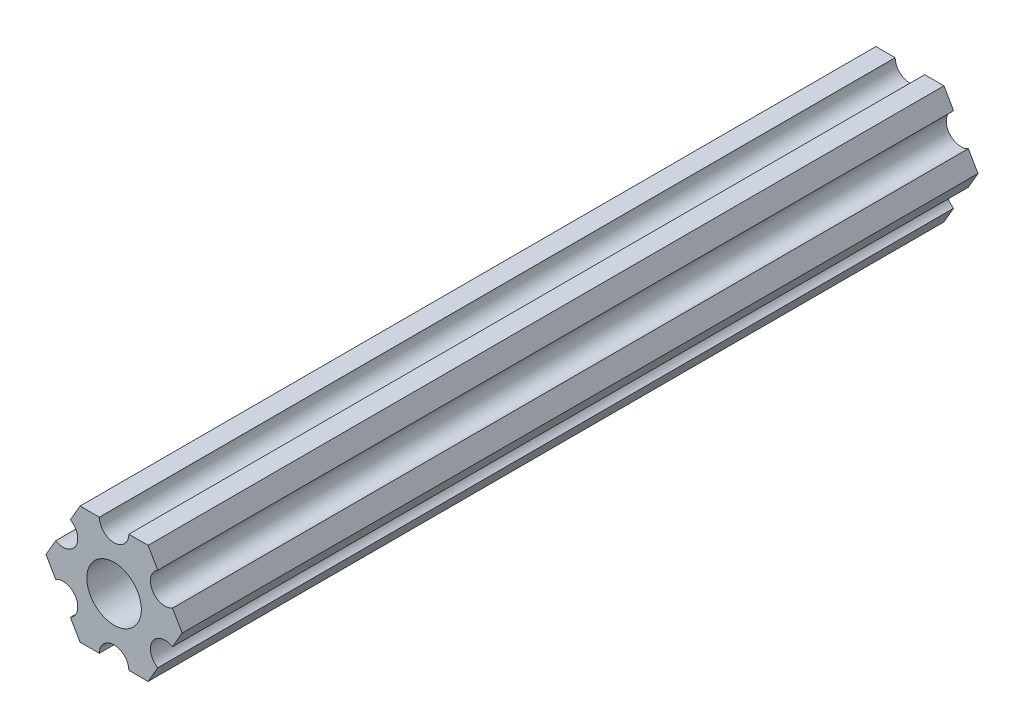
ISO-10303-21;
HEADER;
FILE_DESCRIPTION(('STEP AP214'),'2;1');
FILE_NAME('part.step','',(''),(''),'','','');
FILE_SCHEMA(('AUTOMOTIVE_DESIGN { 1 0 10303 214 1 1 1 1 }'));
ENDSEC;
DATA;
#1=APPLICATION_CONTEXT('core data for automotive mechanical design processes');
#2=APPLICATION_PROTOCOL_DEFINITION('international standard','automotive_design',2000,#1);
#3=PRODUCT_CONTEXT('',#1,'mechanical');
#4=PRODUCT('Part','Part','',(#3));
#5=PRODUCT_RELATED_PRODUCT_CATEGORY('part','',(#4));
#6=PRODUCT_DEFINITION_FORMATION('','',#4);
#7=PRODUCT_DEFINITION_CONTEXT('part definition',#1,'design');
#8=PRODUCT_DEFINITION('design','',#6,#7);
#9=PRODUCT_DEFINITION_SHAPE('','',#8);
#10=(LENGTH_UNIT() NAMED_UNIT(*) SI_UNIT(.MILLI.,.METRE.));
#11=(NAMED_UNIT(*) PLANE_ANGLE_UNIT() SI_UNIT($,.RADIAN.));
#12=(NAMED_UNIT(*) SI_UNIT($,.STERADIAN.) SOLID_ANGLE_UNIT());
#13=UNCERTAINTY_MEASURE_WITH_UNIT(LENGTH_MEASURE(1.E-05),#10,'distance_accuracy_value','');
#14=(GEOMETRIC_REPRESENTATION_CONTEXT(3) GLOBAL_UNCERTAINTY_ASSIGNED_CONTEXT((#13)) GLOBAL_UNIT_ASSIGNED_CONTEXT((#10,
#11,#12)) REPRESENTATION_CONTEXT('',''));
#15=CARTESIAN_POINT('',(0.,0.,0.));
#16=DIRECTION('',(0.,0.,1.));
#17=DIRECTION('',(1.,0.,0.));
#18=AXIS2_PLACEMENT_3D('',#15,#16,#17);
#19=CARTESIAN_POINT('',(6.29301142309,-1.80018429025,85.725));
#20=DIRECTION('',(-0.866025434075772,0.499999947533868,0.));
#21=DIRECTION('',(-0.499999947533868,-0.866025434075772,0.));
#22=AXIS2_PLACEMENT_3D('',#19,#20,#21);
#23=PLANE('',#22);
#24=DIRECTION('',(0.,0.,1.));
#25=VECTOR('',#24,1.);
#26=CARTESIAN_POINT('',(7.33234841875962,4.44126577335676E-07,85.725));
#27=LINE('',#26,#25);
#28=CARTESIAN_POINT('',(7.33234841881321,4.44157516257392E-07,0.));
#29=VERTEX_POINT('',#28);
#30=CARTESIAN_POINT('',(7.33234841881321,4.44157516130901E-07,85.725));
#31=VERTEX_POINT('',#30);
#32=EDGE_CURVE('E89',#29,#31,#27,.T.);
#33=ORIENTED_EDGE('',*,*,#32,.T.);
#34=DIRECTION('',(0.499999947589129,0.866025434043867,0.));
#35=VECTOR('',#34,1.);
#36=CARTESIAN_POINT('',(6.29301142309,-1.80018429025,85.725));
#37=LINE('',#36,#35);
#38=CARTESIAN_POINT('',(6.29301142309229,-1.80018429024603,85.725));
#39=VERTEX_POINT('',#38);
#40=EDGE_CURVE('E180',#39,#31,#37,.T.);
#41=ORIENTED_EDGE('',*,*,#40,.F.);
#42=DIRECTION('',(0.,0.,-1.));
#43=VECTOR('',#42,1.);
#44=CARTESIAN_POINT('',(6.29301142309229,-1.80018429024603,85.725));
#45=LINE('',#44,#43);
#46=CARTESIAN_POINT('',(6.29301142309229,-1.80018429024603,1.86264198509534E-10));
#47=VERTEX_POINT('',#46);
#48=EDGE_CURVE('E245',#39,#47,#45,.T.);
#49=ORIENTED_EDGE('',*,*,#48,.T.);
#50=DIRECTION('',(0.499999947589129,0.866025434043867,0.));
#51=VECTOR('',#50,1.);
#52=CARTESIAN_POINT('',(6.29301142309,-1.80018429025,0.));
#53=LINE('',#52,#51);
#54=EDGE_CURVE('E184',#47,#29,#53,.T.);
#55=ORIENTED_EDGE('',*,*,#54,.T.);
#56=EDGE_LOOP('',(#33,#41,#49,#55));
#57=FACE_BOUND('',#56,.T.);
#58=ADVANCED_FACE('F17',(#57),#23,.F.);
#59=CARTESIAN_POINT('',(7.33234841871,4.4421251917E-07,85.725));
#60=DIRECTION('',(-0.866025373493133,-0.500000052466077,0.));
#61=DIRECTION('',(0.500000052466077,-0.866025373493133,0.));
#62=AXIS2_PLACEMENT_3D('',#59,#60,#61);
#63=PLANE('',#62);
#64=DIRECTION('',(0.,0.,-1.));
#65=VECTOR('',#64,1.);
#66=CARTESIAN_POINT('',(6.29301120515904,1.80018505284885,85.725));
#67=LINE('',#66,#65);
#68=CARTESIAN_POINT('',(6.29301120515903,1.80018505284885,1.86260729062582E-10));
#69=VERTEX_POINT('',#68);
#70=CARTESIAN_POINT('',(6.29301120515903,1.80018505284885,85.725));
#71=VERTEX_POINT('',#70);
#72=EDGE_CURVE('E82',#69,#71,#67,.F.);
#73=ORIENTED_EDGE('',*,*,#72,.T.);
#74=DIRECTION('',(-0.500000052414754,0.866025373522764,0.));
#75=VECTOR('',#74,1.);
#76=CARTESIAN_POINT('',(7.33234841884,4.4417298571825E-07,85.725));
#77=LINE('',#76,#75);
#78=EDGE_CURVE('E159',#31,#71,#77,.T.);
#79=ORIENTED_EDGE('',*,*,#78,.F.);
#80=ORIENTED_EDGE('',*,*,#32,.F.);
#81=DIRECTION('',(-0.500000052414754,0.866025373522764,0.));
#82=VECTOR('',#81,1.);
#83=CARTESIAN_POINT('',(7.33234841884,4.4417298571825E-07,0.));
#84=LINE('',#83,#82);
#85=EDGE_CURVE('E243',#29,#69,#84,.T.);
#86=ORIENTED_EDGE('',*,*,#85,.T.);
#87=EDGE_LOOP('',(#73,#79,#80,#86));
#88=FACE_BOUND('',#87,.T.);
#89=ADVANCED_FACE('F374',(#88),#63,.F.);
#90=CARTESIAN_POINT('',(5.49926112168,3.17500033316,85.725));
#91=DIRECTION('',(0.,0.,-1.));
#92=DIRECTION('',(-1.,0.,0.));
#93=AXIS2_PLACEMENT_3D('',#90,#91,#92);
#94=CYLINDRICAL_SURFACE('',#93,1.5875);
#95=ORIENTED_EDGE('',*,*,#72,.F.);
#96=CARTESIAN_POINT('',(5.49926112168,3.17500033316,3.72521458125163E-10));
#97=DIRECTION('',(0.,0.,-1.));
#98=DIRECTION('',(-1.,0.,0.));
#99=AXIS2_PLACEMENT_3D('',#96,#97,#98);
#100=CIRCLE('',#99,1.5875);
#101=CARTESIAN_POINT('',(4.70551103838994,4.54981561358011,1.86260729062582E-10));
#102=VERTEX_POINT('',#101);
#103=EDGE_CURVE('E20',#69,#102,#100,.T.);
#104=ORIENTED_EDGE('',*,*,#103,.T.);
#105=DIRECTION('',(0.,0.,1.));
#106=VECTOR('',#105,1.);
#107=CARTESIAN_POINT('',(4.70551103839,4.54981561358,85.725));
#108=LINE('',#107,#106);
#109=CARTESIAN_POINT('',(4.70551103838994,4.54981561358011,85.725));
#110=VERTEX_POINT('',#109);
#111=EDGE_CURVE('E161',#102,#110,#108,.T.);
#112=ORIENTED_EDGE('',*,*,#111,.T.);
#113=CARTESIAN_POINT('',(5.49926112168,3.17500033316,85.725));
#114=DIRECTION('',(0.,0.,-1.));
#115=DIRECTION('',(-1.,0.,0.));
#116=AXIS2_PLACEMENT_3D('',#113,#114,#115);
#117=CIRCLE('',#116,1.5875);
#118=EDGE_CURVE('E155',#71,#110,#117,.T.);
#119=ORIENTED_EDGE('',*,*,#118,.F.);
#120=EDGE_LOOP('',(#95,#104,#112,#119));
#121=FACE_BOUND('',#120,.T.);
#122=ADVANCED_FACE('F162',(#121),#94,.F.);
#123=CARTESIAN_POINT('',(4.70551103839,4.54981561358,85.725));
#124=DIRECTION('',(-0.866025373493133,-0.500000052466077,0.));
#125=DIRECTION('',(0.500000052466077,-0.866025373493133,0.));
#126=AXIS2_PLACEMENT_3D('',#123,#124,#125);
#127=PLANE('',#126);
#128=DIRECTION('',(0.,0.,1.));
#129=VECTOR('',#128,1.);
#130=CARTESIAN_POINT('',(3.66617382453,6.35000022211,85.725));
#131=LINE('',#130,#129);
#132=CARTESIAN_POINT('',(3.66617382453,6.35000022213667,0.));
#133=VERTEX_POINT('',#132);
#134=CARTESIAN_POINT('',(3.66617382453,6.35000022213667,85.725));
#135=VERTEX_POINT('',#134);
#136=EDGE_CURVE('E166',#133,#135,#131,.T.);
#137=ORIENTED_EDGE('',*,*,#136,.T.);
#138=DIRECTION('',(-0.500000052501404,0.866025373472737,0.));
#139=VECTOR('',#138,1.);
#140=CARTESIAN_POINT('',(4.70551103839,4.54981561358,85.725));
#141=LINE('',#140,#139);
#142=EDGE_CURVE('E153',#110,#135,#141,.T.);
#143=ORIENTED_EDGE('',*,*,#142,.F.);
#144=ORIENTED_EDGE('',*,*,#111,.F.);
#145=DIRECTION('',(-0.500000052501404,0.866025373472737,0.));
#146=VECTOR('',#145,1.);
#147=CARTESIAN_POINT('',(4.70551103839,4.54981561358,0.));
#148=LINE('',#147,#146);
#149=EDGE_CURVE('E237',#102,#133,#148,.T.);
#150=ORIENTED_EDGE('',*,*,#149,.T.);
#151=EDGE_LOOP('',(#137,#143,#144,#150));
#152=FACE_BOUND('',#151,.T.);
#153=ADVANCED_FACE('F168',(#152),#127,.F.);
#154=CARTESIAN_POINT('',(3.66617382465,6.35000022211,85.725));
#155=DIRECTION('',(6.05825850610999E-08,-0.999999999999998,0.));
#156=DIRECTION('',(0.999999999999998,6.05825850610999E-08,0.));
#157=AXIS2_PLACEMENT_3D('',#154,#155,#156);
#158=PLANE('',#157);
#159=DIRECTION('',(0.,0.,-1.));
#160=VECTOR('',#159,1.);
#161=CARTESIAN_POINT('',(1.58749961530074,6.35000009549,85.725));
#162=LINE('',#161,#160);
#163=CARTESIAN_POINT('',(1.58749961530073,6.35000015882,0.));
#164=VERTEX_POINT('',#163);
#165=CARTESIAN_POINT('',(1.58749961530073,6.35000015882,85.725));
#166=VERTEX_POINT('',#165);
#167=EDGE_CURVE('E288',#164,#166,#162,.F.);
#168=ORIENTED_EDGE('',*,*,#167,.T.);
#169=DIRECTION('',(1.,0.,0.));
#170=VECTOR('',#169,1.);
#171=CARTESIAN_POINT('',(5.49926112168,6.35000022215,85.725));
#172=LINE('',#171,#170);
#173=EDGE_CURVE('E170',#135,#166,#172,.F.);
#174=ORIENTED_EDGE('',*,*,#173,.F.);
#175=ORIENTED_EDGE('',*,*,#136,.F.);
#176=DIRECTION('',(1.,0.,0.));
#177=VECTOR('',#176,1.);
#178=CARTESIAN_POINT('',(5.49926112168,6.35000022215,0.));
#179=LINE('',#178,#177);
#180=EDGE_CURVE('E234',#133,#164,#179,.F.);
#181=ORIENTED_EDGE('',*,*,#180,.T.);
#182=EDGE_LOOP('',(#168,#174,#175,#181));
#183=FACE_BOUND('',#182,.T.);
#184=ADVANCED_FACE('F331',(#183),#158,.F.);
#185=CARTESIAN_POINT('',(-3.8469926006E-07,6.35,85.725));
#186=DIRECTION('',(0.,0.,-1.));
#187=DIRECTION('',(-1.,0.,0.));
#188=AXIS2_PLACEMENT_3D('',#185,#186,#187);
#189=CYLINDRICAL_SURFACE('',#188,1.5875);
#190=DIRECTION('',(0.,0.,1.));
#191=VECTOR('',#190,1.);
#192=CARTESIAN_POINT('',(-1.58750038459,6.34999990383,85.725));
#193=LINE('',#192,#191);
#194=CARTESIAN_POINT('',(-1.58750038464463,6.34999990373,0.));
#195=VERTEX_POINT('',#194);
#196=CARTESIAN_POINT('',(-1.58750038464463,6.34999990383,85.725));
#197=VERTEX_POINT('',#196);
#198=EDGE_CURVE('E136',#195,#197,#193,.T.);
#199=ORIENTED_EDGE('',*,*,#198,.T.);
#200=CARTESIAN_POINT('',(-3.8469926006E-07,6.35,85.725));
#201=DIRECTION('',(0.,0.,-1.));
#202=DIRECTION('',(-1.,0.,0.));
#203=AXIS2_PLACEMENT_3D('',#200,#201,#202);
#204=CIRCLE('',#203,1.5875);
#205=EDGE_CURVE('E172',#166,#197,#204,.T.);
#206=ORIENTED_EDGE('',*,*,#205,.F.);
#207=ORIENTED_EDGE('',*,*,#167,.F.);
#208=CARTESIAN_POINT('',(-3.8469926006E-07,6.35,0.));
#209=DIRECTION('',(0.,0.,-1.));
#210=DIRECTION('',(-1.,0.,0.));
#211=AXIS2_PLACEMENT_3D('',#208,#209,#210);
#212=CIRCLE('',#211,1.5875);
#213=EDGE_CURVE('E231',#164,#195,#212,.T.);
#214=ORIENTED_EDGE('',*,*,#213,.T.);
#215=EDGE_LOOP('',(#199,#206,#207,#214));
#216=FACE_BOUND('',#215,.T.);
#217=ADVANCED_FACE('F325',(#216),#189,.F.);
#218=CARTESIAN_POINT('',(-1.5875003847,6.34999990383,85.725));
#219=DIRECTION('',(6.05825963272999E-08,-0.999999999999998,0.));
#220=DIRECTION('',(0.999999999999998,6.05825963272999E-08,0.));
#221=AXIS2_PLACEMENT_3D('',#218,#219,#220);
#222=PLANE('',#221);
#223=DIRECTION('',(0.,0.,1.));
#224=VECTOR('',#223,1.);
#225=CARTESIAN_POINT('',(-3.66617459464337,6.34999977686225,85.725));
#226=LINE('',#225,#224);
#227=CARTESIAN_POINT('',(-3.66617454601634,6.34999986137408,0.));
#228=VERTEX_POINT('',#227);
#229=CARTESIAN_POINT('',(-3.66617454593936,6.34999986150742,85.725));
#230=VERTEX_POINT('',#229);
#231=EDGE_CURVE('E144',#228,#230,#226,.T.);
#232=ORIENTED_EDGE('',*,*,#231,.T.);
#233=DIRECTION('',(1.,0.,0.));
#234=VECTOR('',#233,1.);
#235=CARTESIAN_POINT('',(5.49926112168,6.34999990383,85.725));
#236=LINE('',#235,#234);
#237=EDGE_CURVE('E314',#197,#230,#236,.F.);
#238=ORIENTED_EDGE('',*,*,#237,.F.);
#239=ORIENTED_EDGE('',*,*,#198,.F.);
#240=DIRECTION('',(1.,0.,0.));
#241=VECTOR('',#240,1.);
#242=CARTESIAN_POINT('',(5.49926112168,6.34999990363,0.));
#243=LINE('',#242,#241);
#244=EDGE_CURVE('E227',#195,#228,#243,.F.);
#245=ORIENTED_EDGE('',*,*,#244,.T.);
#246=EDGE_LOOP('',(#232,#238,#239,#245));
#247=FACE_BOUND('',#246,.T.);
#248=ADVANCED_FACE('F335',(#247),#222,.F.);
#249=CARTESIAN_POINT('',(-3.66617459405,6.34999977789,85.725));
#250=DIRECTION('',(0.866025434075772,-0.499999947533868,0.));
#251=DIRECTION('',(0.499999947533868,0.866025434075772,0.));
#252=AXIS2_PLACEMENT_3D('',#249,#250,#251);
#253=PLANE('',#252);
#254=DIRECTION('',(0.,0.,1.));
#255=VECTOR('',#254,1.);
#256=CARTESIAN_POINT('',(-4.70551158979963,4.54981504320238,85.725));
#257=LINE('',#256,#255);
#258=CARTESIAN_POINT('',(-4.70551158939318,4.5498150431216,85.725));
#259=VERTEX_POINT('',#258);
#260=CARTESIAN_POINT('',(-4.70551158939318,4.5498150431216,0.));
#261=VERTEX_POINT('',#260);
#262=EDGE_CURVE('E281',#259,#261,#257,.F.);
#263=ORIENTED_EDGE('',*,*,#262,.F.);
#264=DIRECTION('',(-0.499999947117134,-0.866025434316374,0.));
#265=VECTOR('',#264,1.);
#266=CARTESIAN_POINT('',(-3.66617459483,6.34999977697,85.725));
#267=LINE('',#266,#265);
#268=EDGE_CURVE('E313',#230,#259,#267,.T.);
#269=ORIENTED_EDGE('',*,*,#268,.F.);
#270=ORIENTED_EDGE('',*,*,#231,.F.);
#271=DIRECTION('',(-0.499999947117134,-0.866025434316374,0.));
#272=VECTOR('',#271,1.);
#273=CARTESIAN_POINT('',(-3.66617459483,6.34999977697,0.));
#274=LINE('',#273,#272);
#275=EDGE_CURVE('E225',#228,#261,#274,.T.);
#276=ORIENTED_EDGE('',*,*,#275,.T.);
#277=EDGE_LOOP('',(#263,#269,#270,#276));
#278=FACE_BOUND('',#277,.T.);
#279=ADVANCED_FACE('F337',(#278),#253,.F.);
#280=CARTESIAN_POINT('',(-5.49926150638,3.17499966684,85.725));
#281=DIRECTION('',(0.,0.,-1.));
#282=DIRECTION('',(-1.,0.,0.));
#283=AXIS2_PLACEMENT_3D('',#280,#281,#282);
#284=CYLINDRICAL_SURFACE('',#283,1.5875);
#285=DIRECTION('',(0.,0.,1.));
#286=VECTOR('',#285,1.);
#287=CARTESIAN_POINT('',(-6.29301142341638,1.8001842896847,85.725));
#288=LINE('',#287,#286);
#289=CARTESIAN_POINT('',(-6.29301142340615,1.80018429005301,0.));
#290=VERTEX_POINT('',#289);
#291=CARTESIAN_POINT('',(-6.29301142325434,1.80018428996536,85.725));
#292=VERTEX_POINT('',#291);
#293=EDGE_CURVE('E276',#290,#292,#288,.T.);
#294=ORIENTED_EDGE('',*,*,#293,.T.);
#295=CARTESIAN_POINT('',(-5.49926150638,3.17499966684,85.725));
#296=DIRECTION('',(0.,0.,-1.));
#297=DIRECTION('',(-1.,0.,0.));
#298=AXIS2_PLACEMENT_3D('',#295,#296,#297);
#299=CIRCLE('',#298,1.5875);
#300=EDGE_CURVE('E310',#259,#292,#299,.T.);
#301=ORIENTED_EDGE('',*,*,#300,.F.);
#302=ORIENTED_EDGE('',*,*,#262,.T.);
#303=CARTESIAN_POINT('',(-5.49926150638,3.17499966684,0.));
#304=DIRECTION('',(0.,0.,-1.));
#305=DIRECTION('',(-1.,0.,0.));
#306=AXIS2_PLACEMENT_3D('',#303,#304,#305);
#307=CIRCLE('',#306,1.5875);
#308=EDGE_CURVE('E222',#261,#290,#307,.T.);
#309=ORIENTED_EDGE('',*,*,#308,.T.);
#310=EDGE_LOOP('',(#294,#301,#302,#309));
#311=FACE_BOUND('',#310,.T.);
#312=ADVANCED_FACE('F428',(#311),#284,.F.);
#313=CARTESIAN_POINT('',(-6.29301142309,1.80018429025,85.725));
#314=DIRECTION('',(0.866025434075772,-0.499999947533868,0.));
#315=DIRECTION('',(0.499999947533868,0.866025434075772,0.));
#316=AXIS2_PLACEMENT_3D('',#313,#314,#315);
#317=PLANE('',#316);
#318=DIRECTION('',(0.,0.,1.));
#319=VECTOR('',#318,1.);
#320=CARTESIAN_POINT('',(-7.33234841849333,-4.44587802990823E-07,85.725));
#321=LINE('',#320,#319);
#322=CARTESIAN_POINT('',(-7.33234841817111,-4.44401768333652E-07,0.));
#323=VERTEX_POINT('',#322);
#324=CARTESIAN_POINT('',(-7.33234841817111,-4.44401768080672E-07,85.725));
#325=VERTEX_POINT('',#324);
#326=EDGE_CURVE('E273',#323,#325,#321,.T.);
#327=ORIENTED_EDGE('',*,*,#326,.T.);
#328=DIRECTION('',(-0.499999947261377,-0.866025434233095,0.));
#329=VECTOR('',#328,1.);
#330=CARTESIAN_POINT('',(-6.29301142309,1.80018429025,85.725));
#331=LINE('',#330,#329);
#332=EDGE_CURVE('E312',#292,#325,#331,.T.);
#333=ORIENTED_EDGE('',*,*,#332,.F.);
#334=ORIENTED_EDGE('',*,*,#293,.F.);
#335=DIRECTION('',(-0.499999947115311,-0.866025434317426,0.));
#336=VECTOR('',#335,1.);
#337=CARTESIAN_POINT('',(-6.29301142372,1.80018428986,0.));
#338=LINE('',#337,#336);
#339=EDGE_CURVE('E217',#290,#323,#338,.T.);
#340=ORIENTED_EDGE('',*,*,#339,.T.);
#341=EDGE_LOOP('',(#327,#333,#334,#340));
#342=FACE_BOUND('',#341,.T.);
#343=ADVANCED_FACE('F424',(#342),#317,.F.);
#344=CARTESIAN_POINT('',(-7.33234841871,-4.44212523791E-07,85.725));
#345=DIRECTION('',(0.866025373493133,0.500000052466077,0.));
#346=DIRECTION('',(-0.500000052466077,0.866025373493133,0.));
#347=AXIS2_PLACEMENT_3D('',#344,#345,#346);
#348=PLANE('',#347);
#349=DIRECTION('',(0.,0.,-1.));
#350=VECTOR('',#349,1.);
#351=CARTESIAN_POINT('',(-6.29301120518242,-1.80018505286235,85.725));
#352=LINE('',#351,#350);
#353=CARTESIAN_POINT('',(-6.29301120518242,-1.80018505286235,0.));
#354=VERTEX_POINT('',#353);
#355=CARTESIAN_POINT('',(-6.29301120518242,-1.80018505286235,85.725));
#356=VERTEX_POINT('',#355);
#357=EDGE_CURVE('E270',#354,#356,#352,.F.);
#358=ORIENTED_EDGE('',*,*,#357,.T.);
#359=DIRECTION('',(0.500000052132314,-0.866025373685831,0.));
#360=VECTOR('',#359,1.);
#361=CARTESIAN_POINT('',(-7.33234841801,-4.44308750815331E-07,85.725));
#362=LINE('',#361,#360);
#363=EDGE_CURVE('E309',#325,#356,#362,.T.);
#364=ORIENTED_EDGE('',*,*,#363,.F.);
#365=ORIENTED_EDGE('',*,*,#326,.F.);
#366=DIRECTION('',(0.500000052132314,-0.866025373685831,0.));
#367=VECTOR('',#366,1.);
#368=CARTESIAN_POINT('',(-7.33234841801,-4.44308750815331E-07,0.));
#369=LINE('',#368,#367);
#370=EDGE_CURVE('E214',#323,#354,#369,.T.);
#371=ORIENTED_EDGE('',*,*,#370,.T.);
#372=EDGE_LOOP('',(#358,#364,#365,#371));
#373=FACE_BOUND('',#372,.T.);
#374=ADVANCED_FACE('F420',(#373),#348,.F.);
#375=CARTESIAN_POINT('',(-5.49926112168,-3.17500033316,85.725));
#376=DIRECTION('',(0.,0.,-1.));
#377=DIRECTION('',(-1.,0.,0.));
#378=AXIS2_PLACEMENT_3D('',#375,#376,#377);
#379=CYLINDRICAL_SURFACE('',#378,1.5875);
#380=ORIENTED_EDGE('',*,*,#357,.F.);
#381=CARTESIAN_POINT('',(-5.49926112168,-3.17500033316,0.));
#382=DIRECTION('',(0.,0.,-1.));
#383=DIRECTION('',(-1.,0.,0.));
#384=AXIS2_PLACEMENT_3D('',#381,#382,#383);
#385=CIRCLE('',#384,1.5875);
#386=CARTESIAN_POINT('',(-4.70551103808494,-4.54981561324511,0.));
#387=VERTEX_POINT('',#386);
#388=EDGE_CURVE('E211',#354,#387,#385,.T.);
#389=ORIENTED_EDGE('',*,*,#388,.T.);
#390=DIRECTION('',(0.,0.,1.));
#391=VECTOR('',#390,1.);
#392=CARTESIAN_POINT('',(-4.70551103852762,-4.54981561334164,85.725));
#393=LINE('',#392,#391);
#394=CARTESIAN_POINT('',(-4.70551103845875,-4.54981561346093,85.725));
#395=VERTEX_POINT('',#394);
#396=EDGE_CURVE('E265',#387,#395,#393,.T.);
#397=ORIENTED_EDGE('',*,*,#396,.T.);
#398=CARTESIAN_POINT('',(-5.49926112168,-3.17500033316,85.725));
#399=DIRECTION('',(0.,0.,-1.));
#400=DIRECTION('',(-1.,0.,0.));
#401=AXIS2_PLACEMENT_3D('',#398,#399,#400);
#402=CIRCLE('',#401,1.5875);
#403=EDGE_CURVE('E306',#356,#395,#402,.T.);
#404=ORIENTED_EDGE('',*,*,#403,.F.);
#405=EDGE_LOOP('',(#380,#389,#397,#404));
#406=FACE_BOUND('',#405,.T.);
#407=ADVANCED_FACE('F416',(#406),#379,.F.);
#408=CARTESIAN_POINT('',(-4.70551103839,-4.54981561358,85.725));
#409=DIRECTION('',(0.866025373493133,0.500000052466077,0.));
#410=DIRECTION('',(-0.500000052466077,0.866025373493133,0.));
#411=AXIS2_PLACEMENT_3D('',#408,#409,#410);
#412=PLANE('',#411);
#413=DIRECTION('',(0.,0.,1.));
#414=VECTOR('',#413,1.);
#415=CARTESIAN_POINT('',(-3.66617382556,-6.35000022211,85.725));
#416=LINE('',#415,#414);
#417=CARTESIAN_POINT('',(-3.66617382556,-6.35000022222333,0.));
#418=VERTEX_POINT('',#417);
#419=CARTESIAN_POINT('',(-3.66617382556,-6.35000022222333,85.725));
#420=VERTEX_POINT('',#419);
#421=EDGE_CURVE('E262',#418,#420,#416,.T.);
#422=ORIENTED_EDGE('',*,*,#421,.T.);
#423=DIRECTION('',(0.500000052102693,-0.866025373702933,0.));
#424=VECTOR('',#423,1.);
#425=CARTESIAN_POINT('',(-4.70551103839,-4.54981561358,85.725));
#426=LINE('',#425,#424);
#427=EDGE_CURVE('E308',#395,#420,#426,.T.);
#428=ORIENTED_EDGE('',*,*,#427,.F.);
#429=ORIENTED_EDGE('',*,*,#396,.F.);
#430=DIRECTION('',(0.500000051743032,-0.866025373910583,0.));
#431=VECTOR('',#430,1.);
#432=CARTESIAN_POINT('',(-4.70551103778,-4.54981561291,0.));
#433=LINE('',#432,#431);
#434=EDGE_CURVE('E206',#387,#418,#433,.T.);
#435=ORIENTED_EDGE('',*,*,#434,.T.);
#436=EDGE_LOOP('',(#422,#428,#429,#435));
#437=FACE_BOUND('',#436,.T.);
#438=ADVANCED_FACE('F412',(#437),#412,.F.);
#439=CARTESIAN_POINT('',(-3.66617382465,-6.35000022211,85.725));
#440=DIRECTION('',(-6.05825854783999E-08,0.999999999999998,0.));
#441=DIRECTION('',(-0.999999999999998,-6.05825854783999E-08,0.));
#442=AXIS2_PLACEMENT_3D('',#439,#440,#441);
#443=PLANE('',#442);
#444=DIRECTION('',(0.,0.,-1.));
#445=VECTOR('',#444,1.);
#446=CARTESIAN_POINT('',(-1.58749961530074,-6.35,85.725));
#447=LINE('',#446,#445);
#448=CARTESIAN_POINT('',(-1.58749961530073,-6.35000011114,3.72521458125163E-10));
#449=VERTEX_POINT('',#448);
#450=CARTESIAN_POINT('',(-1.58749961530073,-6.35000011114,85.725));
#451=VERTEX_POINT('',#450);
#452=EDGE_CURVE('E259',#449,#451,#447,.F.);
#453=ORIENTED_EDGE('',*,*,#452,.T.);
#454=DIRECTION('',(1.,0.,0.));
#455=VECTOR('',#454,1.);
#456=CARTESIAN_POINT('',(5.49926112168,-6.35000022228,85.725));
#457=LINE('',#456,#455);
#458=EDGE_CURVE('E305',#420,#451,#457,.T.);
#459=ORIENTED_EDGE('',*,*,#458,.F.);
#460=ORIENTED_EDGE('',*,*,#421,.F.);
#461=DIRECTION('',(1.,0.,0.));
#462=VECTOR('',#461,1.);
#463=CARTESIAN_POINT('',(5.49926112168,-6.35000022228,0.));
#464=LINE('',#463,#462);
#465=EDGE_CURVE('E203',#418,#449,#464,.T.);
#466=ORIENTED_EDGE('',*,*,#465,.T.);
#467=EDGE_LOOP('',(#453,#459,#460,#466));
#468=FACE_BOUND('',#467,.T.);
#469=ADVANCED_FACE('F408',(#468),#443,.F.);
#470=CARTESIAN_POINT('',(3.84699262043E-07,-6.35,85.725));
#471=DIRECTION('',(0.,0.,-1.));
#472=DIRECTION('',(-1.,0.,0.));
#473=AXIS2_PLACEMENT_3D('',#470,#471,#472);
#474=CYLINDRICAL_SURFACE('',#473,1.5875);
#475=DIRECTION('',(0.,0.,1.));
#476=VECTOR('',#475,1.);
#477=CARTESIAN_POINT('',(1.5875003847,-6.34999990383,85.725));
#478=LINE('',#477,#476);
#479=CARTESIAN_POINT('',(1.58750038469963,-6.34999990383,1.86264198509534E-10));
#480=VERTEX_POINT('',#479);
#481=CARTESIAN_POINT('',(1.58750038469963,-6.34999990383,85.725));
#482=VERTEX_POINT('',#481);
#483=EDGE_CURVE('E254',#480,#482,#478,.T.);
#484=ORIENTED_EDGE('',*,*,#483,.T.);
#485=CARTESIAN_POINT('',(3.84699262043E-07,-6.35,85.725));
#486=DIRECTION('',(0.,0.,-1.));
#487=DIRECTION('',(-1.,0.,0.));
#488=AXIS2_PLACEMENT_3D('',#485,#486,#487);
#489=CIRCLE('',#488,1.5875);
#490=EDGE_CURVE('E302',#451,#482,#489,.T.);
#491=ORIENTED_EDGE('',*,*,#490,.F.);
#492=ORIENTED_EDGE('',*,*,#452,.F.);
#493=CARTESIAN_POINT('',(3.84699262043E-07,-6.35,3.72521458125163E-10));
#494=DIRECTION('',(0.,0.,-1.));
#495=DIRECTION('',(-1.,0.,0.));
#496=AXIS2_PLACEMENT_3D('',#493,#494,#495);
#497=CIRCLE('',#496,1.5875);
#498=EDGE_CURVE('E200',#449,#480,#497,.T.);
#499=ORIENTED_EDGE('',*,*,#498,.T.);
#500=EDGE_LOOP('',(#484,#491,#492,#499));
#501=FACE_BOUND('',#500,.T.);
#502=ADVANCED_FACE('F404',(#501),#474,.F.);
#503=CARTESIAN_POINT('',(1.5875003847,-6.34999990383,85.725));
#504=DIRECTION('',(-6.05825721257999E-08,0.999999999999998,0.));
#505=DIRECTION('',(-0.999999999999998,-6.05825721257999E-08,0.));
#506=AXIS2_PLACEMENT_3D('',#503,#504,#505);
#507=PLANE('',#506);
#508=DIRECTION('',(0.,0.,1.));
#509=VECTOR('',#508,1.);
#510=CARTESIAN_POINT('',(3.66617459432525,-6.34999977741325,85.725));
#511=LINE('',#510,#509);
#512=CARTESIAN_POINT('',(3.66617454520054,-6.34999986169108,0.));
#513=VERTEX_POINT('',#512);
#514=CARTESIAN_POINT('',(3.66617454520054,-6.34999986169108,85.725));
#515=VERTEX_POINT('',#514);
#516=EDGE_CURVE('E251',#513,#515,#511,.T.);
#517=ORIENTED_EDGE('',*,*,#516,.T.);
#518=DIRECTION('',(1.,0.,0.));
#519=VECTOR('',#518,1.);
#520=CARTESIAN_POINT('',(5.49926112168,-6.34999990383,85.725));
#521=LINE('',#520,#519);
#522=EDGE_CURVE('E304',#482,#515,#521,.T.);
#523=ORIENTED_EDGE('',*,*,#522,.F.);
#524=ORIENTED_EDGE('',*,*,#483,.F.);
#525=DIRECTION('',(1.,0.,0.));
#526=VECTOR('',#525,1.);
#527=CARTESIAN_POINT('',(5.49926112168,-6.34999990383,0.));
#528=LINE('',#527,#526);
#529=EDGE_CURVE('E195',#480,#513,#528,.T.);
#530=ORIENTED_EDGE('',*,*,#529,.T.);
#531=EDGE_LOOP('',(#517,#523,#524,#530));
#532=FACE_BOUND('',#531,.T.);
#533=ADVANCED_FACE('F401',(#532),#507,.F.);
#534=CARTESIAN_POINT('',(3.66617459405,-6.34999977789,85.725));
#535=DIRECTION('',(-0.866025434075772,0.499999947533868,0.));
#536=DIRECTION('',(-0.499999947533868,-0.866025434075772,0.));
#537=AXIS2_PLACEMENT_3D('',#534,#535,#536);
#538=PLANE('',#537);
#539=DIRECTION('',(0.,0.,1.));
#540=VECTOR('',#539,1.);
#541=CARTESIAN_POINT('',(4.70551158995084,-4.54981504294048,85.725));
#542=LINE('',#541,#540);
#543=CARTESIAN_POINT('',(4.70551158980818,-4.5498150431866,85.725));
#544=VERTEX_POINT('',#543);
#545=CARTESIAN_POINT('',(4.70551158980797,-4.54981504318648,1.86267667956486E-10));
#546=VERTEX_POINT('',#545);
#547=EDGE_CURVE('E249',#544,#546,#542,.F.);
#548=ORIENTED_EDGE('',*,*,#547,.F.);
#549=DIRECTION('',(0.499999947786152,0.866025433930116,0.));
#550=VECTOR('',#549,1.);
#551=CARTESIAN_POINT('',(3.6661745938,-6.34999977711,85.725));
#552=LINE('',#551,#550);
#553=EDGE_CURVE('E301',#515,#544,#552,.T.);
#554=ORIENTED_EDGE('',*,*,#553,.F.);
#555=ORIENTED_EDGE('',*,*,#516,.F.);
#556=DIRECTION('',(0.499999947786152,0.866025433930116,0.));
#557=VECTOR('',#556,1.);
#558=CARTESIAN_POINT('',(3.6661745938,-6.34999977711,0.));
#559=LINE('',#558,#557);
#560=EDGE_CURVE('E192',#513,#546,#559,.T.);
#561=ORIENTED_EDGE('',*,*,#560,.T.);
#562=EDGE_LOOP('',(#548,#554,#555,#561));
#563=FACE_BOUND('',#562,.T.);
#564=ADVANCED_FACE('F368',(#563),#538,.F.);
#565=CARTESIAN_POINT('',(5.49926150638,-3.17499966684,85.725));
#566=DIRECTION('',(0.,0.,-1.));
#567=DIRECTION('',(-1.,0.,0.));
#568=AXIS2_PLACEMENT_3D('',#565,#566,#567);
#569=CYLINDRICAL_SURFACE('',#568,1.5875);
#570=ORIENTED_EDGE('',*,*,#48,.F.);
#571=CARTESIAN_POINT('',(5.49926150638,-3.17499966684,85.725));
#572=DIRECTION('',(0.,0.,-1.));
#573=DIRECTION('',(-1.,0.,0.));
#574=AXIS2_PLACEMENT_3D('',#571,#572,#573);
#575=CIRCLE('',#574,1.5875);
#576=EDGE_CURVE('E35',#544,#39,#575,.T.);
#577=ORIENTED_EDGE('',*,*,#576,.F.);
#578=ORIENTED_EDGE('',*,*,#547,.T.);
#579=CARTESIAN_POINT('',(5.49926150638,-3.17499966684,3.72521458125163E-10));
#580=DIRECTION('',(0.,0.,-1.));
#581=DIRECTION('',(-1.,0.,0.));
#582=AXIS2_PLACEMENT_3D('',#579,#580,#581);
#583=CIRCLE('',#582,1.5875);
#584=EDGE_CURVE('E189',#546,#47,#583,.T.);
#585=ORIENTED_EDGE('',*,*,#584,.T.);
#586=EDGE_LOOP('',(#570,#577,#578,#585));
#587=FACE_BOUND('',#586,.T.);
#588=ADVANCED_FACE('F370',(#587),#569,.F.);
#589=CARTESIAN_POINT('',(5.49926112168,3.17500033316,0.));
#590=DIRECTION('',(0.,0.,1.));
#591=DIRECTION('',(1.,0.,0.));
#592=AXIS2_PLACEMENT_3D('',#589,#590,#591);
#593=PLANE('',#592);
#594=CARTESIAN_POINT('',(0.,0.,0.));
#595=DIRECTION('',(0.,0.,-1.));
#596=DIRECTION('',(-1.,0.,0.));
#597=AXIS2_PLACEMENT_3D('',#594,#595,#596);
#598=CIRCLE('',#597,2.9337);
#599=CARTESIAN_POINT('',(-2.9337,0.,0.));
#600=VERTEX_POINT('',#599);
#601=EDGE_CURVE('E26',#600,#600,#598,.F.);
#602=ORIENTED_EDGE('',*,*,#601,.T.);
#603=EDGE_LOOP('',(#602));
#604=FACE_BOUND('',#603,.T.);
#605=ORIENTED_EDGE('',*,*,#584,.F.);
#606=ORIENTED_EDGE('',*,*,#560,.F.);
#607=ORIENTED_EDGE('',*,*,#529,.F.);
#608=ORIENTED_EDGE('',*,*,#498,.F.);
#609=ORIENTED_EDGE('',*,*,#465,.F.);
#610=ORIENTED_EDGE('',*,*,#434,.F.);
#611=ORIENTED_EDGE('',*,*,#388,.F.);
#612=ORIENTED_EDGE('',*,*,#370,.F.);
#613=ORIENTED_EDGE('',*,*,#339,.F.);
#614=ORIENTED_EDGE('',*,*,#308,.F.);
#615=ORIENTED_EDGE('',*,*,#275,.F.);
#616=ORIENTED_EDGE('',*,*,#244,.F.);
#617=ORIENTED_EDGE('',*,*,#213,.F.);
#618=ORIENTED_EDGE('',*,*,#180,.F.);
#619=ORIENTED_EDGE('',*,*,#149,.F.);
#620=ORIENTED_EDGE('',*,*,#103,.F.);
#621=ORIENTED_EDGE('',*,*,#85,.F.);
#622=ORIENTED_EDGE('',*,*,#54,.F.);
#623=EDGE_LOOP('',(#605,#606,#607,#608,#609,#610,#611,#612,#613,#614,#615,#616,#617,#618,#619,
#620,#621,#622));
#624=FACE_BOUND('',#623,.T.);
#625=ADVANCED_FACE('F329',(#604,#624),#593,.F.);
#626=CARTESIAN_POINT('',(5.49926112168,3.17500033316,85.725));
#627=DIRECTION('',(0.,0.,1.));
#628=DIRECTION('',(1.,0.,0.));
#629=AXIS2_PLACEMENT_3D('',#626,#627,#628);
#630=PLANE('',#629);
#631=CARTESIAN_POINT('',(0.,0.,85.725));
#632=DIRECTION('',(0.,0.,-1.));
#633=DIRECTION('',(-1.,0.,0.));
#634=AXIS2_PLACEMENT_3D('',#631,#632,#633);
#635=CIRCLE('',#634,2.9337);
#636=CARTESIAN_POINT('',(-2.9337,0.,85.725));
#637=VERTEX_POINT('',#636);
#638=EDGE_CURVE('E11',#637,#637,#635,.T.);
#639=ORIENTED_EDGE('',*,*,#638,.T.);
#640=EDGE_LOOP('',(#639));
#641=FACE_BOUND('',#640,.T.);
#642=ORIENTED_EDGE('',*,*,#553,.T.);
#643=ORIENTED_EDGE('',*,*,#576,.T.);
#644=ORIENTED_EDGE('',*,*,#40,.T.);
#645=ORIENTED_EDGE('',*,*,#78,.T.);
#646=ORIENTED_EDGE('',*,*,#118,.T.);
#647=ORIENTED_EDGE('',*,*,#142,.T.);
#648=ORIENTED_EDGE('',*,*,#173,.T.);
#649=ORIENTED_EDGE('',*,*,#205,.T.);
#650=ORIENTED_EDGE('',*,*,#237,.T.);
#651=ORIENTED_EDGE('',*,*,#268,.T.);
#652=ORIENTED_EDGE('',*,*,#300,.T.);
#653=ORIENTED_EDGE('',*,*,#332,.T.);
#654=ORIENTED_EDGE('',*,*,#363,.T.);
#655=ORIENTED_EDGE('',*,*,#403,.T.);
#656=ORIENTED_EDGE('',*,*,#427,.T.);
#657=ORIENTED_EDGE('',*,*,#458,.T.);
#658=ORIENTED_EDGE('',*,*,#490,.T.);
#659=ORIENTED_EDGE('',*,*,#522,.T.);
#660=EDGE_LOOP('',(#642,#643,#644,#645,#646,#647,#648,#649,#650,#651,#652,#653,#654,#655,#656,
#657,#658,#659));
#661=FACE_BOUND('',#660,.T.);
#662=ADVANCED_FACE('F157',(#641,#661),#630,.T.);
#663=CARTESIAN_POINT('',(0.,0.,85.725));
#664=DIRECTION('',(0.,0.,-1.));
#665=DIRECTION('',(-1.,0.,0.));
#666=AXIS2_PLACEMENT_3D('',#663,#664,#665);
#667=CYLINDRICAL_SURFACE('',#666,2.9337);
#668=ORIENTED_EDGE('',*,*,#601,.F.);
#669=EDGE_LOOP('',(#668));
#670=FACE_BOUND('',#669,.T.);
#671=ORIENTED_EDGE('',*,*,#638,.F.);
#672=EDGE_LOOP('',(#671));
#673=FACE_BOUND('',#672,.T.);
#674=ADVANCED_FACE('F382',(#670,#673),#667,.F.);
#675=CLOSED_SHELL('',(#58,#89,#122,#153,#184,#217,#248,#279,#312,#343,#374,#407,#438,#469,#502,
#533,#564,#588,#625,#662,#674));
#676=MANIFOLD_SOLID_BREP('B1',#675);
#677=ADVANCED_BREP_SHAPE_REPRESENTATION('',(#18,#676),#14);
#678=SHAPE_DEFINITION_REPRESENTATION(#9,#677);
ENDSEC;
END-ISO-10303-21;
